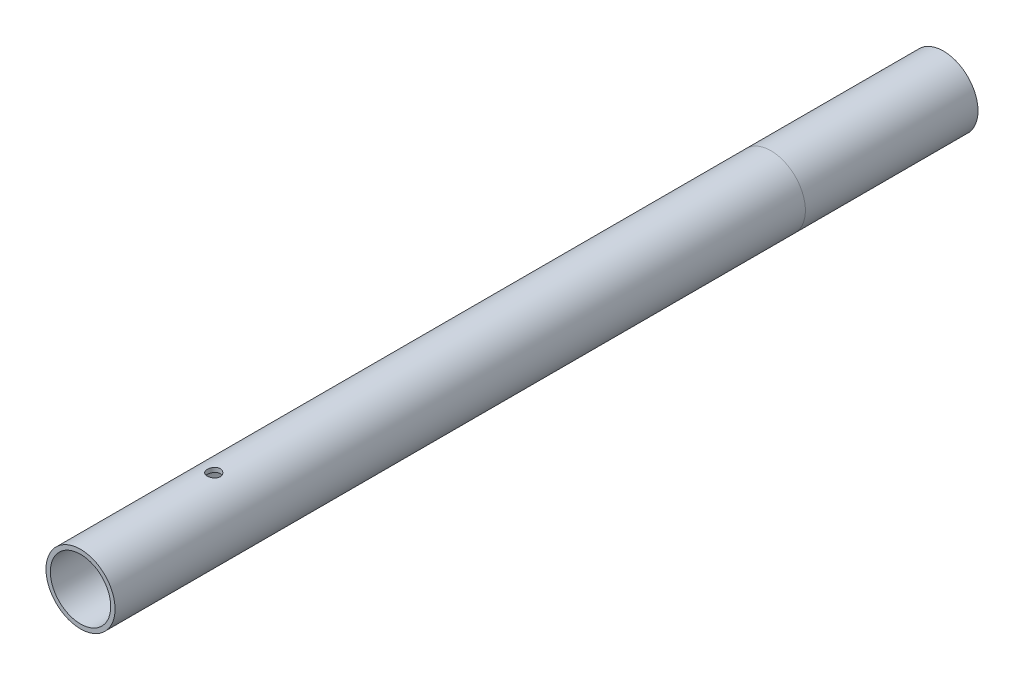
ISO-10303-21;
HEADER;
FILE_DESCRIPTION(('STEP AP214'),'2;1');
FILE_NAME('part.step','',(''),(''),'','','');
FILE_SCHEMA(('AUTOMOTIVE_DESIGN { 1 0 10303 214 1 1 1 1 }'));
ENDSEC;
DATA;
#1=APPLICATION_CONTEXT('core data for automotive mechanical design processes');
#2=APPLICATION_PROTOCOL_DEFINITION('international standard','automotive_design',2000,#1);
#3=PRODUCT_CONTEXT('',#1,'mechanical');
#4=PRODUCT('Part','Part','',(#3));
#5=PRODUCT_RELATED_PRODUCT_CATEGORY('part','',(#4));
#6=PRODUCT_DEFINITION_FORMATION('','',#4);
#7=PRODUCT_DEFINITION_CONTEXT('part definition',#1,'design');
#8=PRODUCT_DEFINITION('design','',#6,#7);
#9=PRODUCT_DEFINITION_SHAPE('','',#8);
#10=(LENGTH_UNIT() NAMED_UNIT(*) SI_UNIT(.MILLI.,.METRE.));
#11=(NAMED_UNIT(*) PLANE_ANGLE_UNIT() SI_UNIT($,.RADIAN.));
#12=(NAMED_UNIT(*) SI_UNIT($,.STERADIAN.) SOLID_ANGLE_UNIT());
#13=UNCERTAINTY_MEASURE_WITH_UNIT(LENGTH_MEASURE(1.E-05),#10,'distance_accuracy_value','');
#14=(GEOMETRIC_REPRESENTATION_CONTEXT(3) GLOBAL_UNCERTAINTY_ASSIGNED_CONTEXT((#13)) GLOBAL_UNIT_ASSIGNED_CONTEXT((#10,
#11,#12)) REPRESENTATION_CONTEXT('',''));
#15=CARTESIAN_POINT('',(0.,0.,0.));
#16=DIRECTION('',(0.,0.,1.));
#17=DIRECTION('',(1.,0.,0.));
#18=AXIS2_PLACEMENT_3D('',#15,#16,#17);
#19=CARTESIAN_POINT('',(0.,0.,200.));
#20=DIRECTION('',(0.,0.,-1.));
#21=DIRECTION('',(-1.,0.,0.));
#22=AXIS2_PLACEMENT_3D('',#19,#20,#21);
#23=CYLINDRICAL_SURFACE('',#22,8.);
#24=CARTESIAN_POINT('',(0.,-8.,170.63));
#25=CARTESIAN_POINT('',(0.083471746465471,-7.99999848833852,170.629996810412));
#26=CARTESIAN_POINT('',(0.166984992730098,-7.99868009921714,170.623008923381));
#27=CARTESIAN_POINT('',(0.331658129841796,-7.9935478589052,170.595260004882));
#28=CARTESIAN_POINT('',(0.412815974152224,-7.98973190166897,170.57448734936));
#29=CARTESIAN_POINT('',(0.570372961851795,-7.98003138765458,170.519827298741));
#30=CARTESIAN_POINT('',(0.646776330685334,-7.97414869946483,170.485951747547));
#31=CARTESIAN_POINT('',(0.792807973093995,-7.96095710599784,170.406081123077));
#32=CARTESIAN_POINT('',(0.862436794477313,-7.9536483161829,170.360087030855));
#33=CARTESIAN_POINT('',(0.993783715930497,-7.93831336430504,170.256700231996));
#34=CARTESIAN_POINT('',(1.05540895503183,-7.93028034856351,170.19919055533));
#35=CARTESIAN_POINT('',(1.16819606135369,-7.9144531845865,170.074656690912));
#36=CARTESIAN_POINT('',(1.21935717689241,-7.90665905354528,170.007631820231));
#37=CARTESIAN_POINT('',(1.31014998665793,-7.89212551245006,169.865313911636));
#38=CARTESIAN_POINT('',(1.34968721969605,-7.88539493886182,169.789959629683));
#39=CARTESIAN_POINT('',(1.41550524332283,-7.87384713211987,169.633531084823));
#40=CARTESIAN_POINT('',(1.44178717713099,-7.86902973396962,169.552457315889));
#41=CARTESIAN_POINT('',(1.480050535035,-7.8619226957455,169.387884769086));
#42=CARTESIAN_POINT('',(1.49219390192039,-7.85960445366405,169.304424902797));
#43=CARTESIAN_POINT('',(1.50233808095347,-7.85767197152761,169.136622615192));
#44=CARTESIAN_POINT('',(1.50034016135374,-7.85805748898759,169.052280273698));
#45=CARTESIAN_POINT('',(1.48238979602363,-7.86146292701752,168.886280474734));
#46=CARTESIAN_POINT('',(1.46662149996046,-7.86444808147334,168.8046022857));
#47=CARTESIAN_POINT('',(1.42186799396208,-7.87266183284666,168.645071580217));
#48=CARTESIAN_POINT('',(1.392882222395,-7.87789052509516,168.567219226491));
#49=CARTESIAN_POINT('',(1.322336471793,-7.89003855292588,168.417011321));
#50=CARTESIAN_POINT('',(1.28070213532456,-7.89696783823366,168.344691529419));
#51=CARTESIAN_POINT('',(1.18609368930416,-7.91172971602918,168.20799527146));
#52=CARTESIAN_POINT('',(1.13311842889266,-7.91956240015522,168.143619612285));
#53=CARTESIAN_POINT('',(1.01633905685297,-7.93540001272164,168.023575044328));
#54=CARTESIAN_POINT('',(0.952377436860678,-7.94340571024031,167.968059347548));
#55=CARTESIAN_POINT('',(0.815968037098825,-7.95857386108318,167.868522759325));
#56=CARTESIAN_POINT('',(0.743520172255773,-7.96573630595245,167.82450198313));
#57=CARTESIAN_POINT('',(0.592034988874674,-7.97842539677509,167.74918224613));
#58=CARTESIAN_POINT('',(0.512989564446497,-7.98394999136289,167.717899220882));
#59=CARTESIAN_POINT('',(0.3506391153987,-7.99272505402719,167.669097906908));
#60=CARTESIAN_POINT('',(0.267334544277792,-7.99597576367994,167.651578155955));
#61=CARTESIAN_POINT('',(0.100148652903392,-7.9998036064198,167.631013968982));
#62=CARTESIAN_POINT('',(0.0162940126341425,-8.00041950912279,167.62775960847));
#63=CARTESIAN_POINT('',(-0.150761248092176,-7.99901543598228,167.635255479548));
#64=CARTESIAN_POINT('',(-0.233961900480378,-7.99699558964431,167.646005023065));
#65=CARTESIAN_POINT('',(-0.396681573218207,-7.99057111500407,167.681029035183));
#66=CARTESIAN_POINT('',(-0.47622426104605,-7.98618522374031,167.705197282538));
#67=CARTESIAN_POINT('',(-0.63012863182462,-7.97551842212498,167.766257706779));
#68=CARTESIAN_POINT('',(-0.704489962595092,-7.96923738311335,167.803150747566));
#69=CARTESIAN_POINT('',(-0.846816671513208,-7.95538030357666,167.889078128159));
#70=CARTESIAN_POINT('',(-0.914703277015118,-7.94779086174563,167.938240738537));
#71=CARTESIAN_POINT('',(-1.04133832326454,-7.93219343489711,168.047138137362));
#72=CARTESIAN_POINT('',(-1.10008590976086,-7.92418541084687,168.106873913001));
#73=CARTESIAN_POINT('',(-1.20757295872047,-7.9085247569745,168.236172318911));
#74=CARTESIAN_POINT('',(-1.25616916218576,-7.90087825860257,168.305854908125));
#75=CARTESIAN_POINT('',(-1.34096675057787,-7.88692985578532,168.452517624524));
#76=CARTESIAN_POINT('',(-1.37716859613924,-7.8806279013735,168.52949748037));
#77=CARTESIAN_POINT('',(-1.43594673512823,-7.87013024209574,168.688205867243));
#78=CARTESIAN_POINT('',(-1.45858868794786,-7.86592440436878,168.769909379559));
#79=CARTESIAN_POINT('',(-1.48980679326235,-7.86007203802415,168.936047222521));
#80=CARTESIAN_POINT('',(-1.49838453270708,-7.8584252206579,169.02048124397));
#81=CARTESIAN_POINT('',(-1.50117762148355,-7.85789199803857,169.188248331442));
#82=CARTESIAN_POINT('',(-1.49561895003499,-7.85896215974293,169.271577580957));
#83=CARTESIAN_POINT('',(-1.47079175378803,-7.86364600659998,169.436091422045));
#84=CARTESIAN_POINT('',(-1.45152331089332,-7.86725967655746,169.517276026427));
#85=CARTESIAN_POINT('',(-1.39991887583264,-7.8766050802318,169.675074484795));
#86=CARTESIAN_POINT('',(-1.36760735397254,-7.88233284594965,169.751696591346));
#87=CARTESIAN_POINT('',(-1.29085868912206,-7.8952638755184,169.898468254241));
#88=CARTESIAN_POINT('',(-1.24642068948187,-7.90246724360119,169.968617352845));
#89=CARTESIAN_POINT('',(-1.14589487339536,-7.91767266107745,170.101583680042));
#90=CARTESIAN_POINT('',(-1.08964259864305,-7.92568505353043,170.164275412567));
#91=CARTESIAN_POINT('',(-0.967427926742305,-7.94152833918735,170.279405162465));
#92=CARTESIAN_POINT('',(-0.901463301891633,-7.94935919027328,170.33184082098));
#93=CARTESIAN_POINT('',(-0.760984945071896,-7.96403975968049,170.425410952627));
#94=CARTESIAN_POINT('',(-0.686399590640543,-7.97088000990561,170.466439428491));
#95=CARTESIAN_POINT('',(-0.531290113653857,-7.98271619380687,170.535317636605));
#96=CARTESIAN_POINT('',(-0.450771651705265,-7.98771385879037,170.563179747047));
#97=CARTESIAN_POINT('',(-0.308347202825166,-7.99428290707632,170.599277314419));
#98=CARTESIAN_POINT('',(-0.247273810251881,-7.99641470878206,170.610778630313));
#99=CARTESIAN_POINT('',(-0.124141247115165,-7.9992737995401,170.626141062116));
#100=CARTESIAN_POINT('',(-0.0620821016527126,-8.00000112429805,170.630002372256));
#101=CARTESIAN_POINT('',(0.,-8.,170.63));
#102=B_SPLINE_CURVE_WITH_KNOTS('',3,(#24,#25,#26,#27,#28,#29,#30,#31,#32,#33,#34,#35,#36,#37,
#38,#39,#40,#41,#42,#43,#44,#45,#46,#47,#48,#49,#50,#51,#52,#53,#54,#55,#56,#57,#58,#59,#60,#61,
#62,#63,#64,#65,#66,#67,#68,#69,#70,#71,#72,#73,#74,#75,#76,#77,#78,#79,#80,#81,#82,#83,#84,#85,
#86,#87,#88,#89,#90,#91,#92,#93,#94,#95,#96,#97,#98,#99,#100,#101),.UNSPECIFIED.,.T.,.F.,(4,2,2,
2,2,2,2,2,2,2,2,2,2,2,2,2,2,2,2,2,2,2,2,2,2,2,2,2,2,2,2,2,2,2,2,2,2,2,4),(0.,0.250188200964923,
0.500587642535447,0.750761271230892,1.00091465336891,1.2537511801363,1.50660586283616,
1.76146190504356,2.01629596311951,2.26818151445336,2.52004447587254,2.76859000612763,
3.01714609846788,3.26719262629534,3.51726454049861,3.77127768464078,4.02529337544948,
4.27962588321699,4.53393136673746,4.78448174076097,5.03501980464584,5.28360233907829,
5.53220175338032,5.78351778017709,6.03485728413099,6.28953436987299,6.54420198954946,
6.79762627818558,7.05102196946515,7.30039252231752,7.54976158541508,7.79866496207693,
8.04758592655423,8.30023369966383,8.55293951262255,8.80792048916314,9.06266126931174,
9.24874344524411,9.43482089039543),.UNSPECIFIED.);
#103=CARTESIAN_POINT('',(0.,-8.,170.63));
#104=VERTEX_POINT('',#103);
#105=EDGE_CURVE('E90',#104,#104,#102,.T.);
#106=ORIENTED_EDGE('',*,*,#105,.T.);
#107=EDGE_LOOP('',(#106));
#108=FACE_BOUND('',#107,.T.);
#109=CARTESIAN_POINT('',(0.,8.,170.63));
#110=CARTESIAN_POINT('',(-0.083471746465471,7.99999848833852,170.629996810412));
#111=CARTESIAN_POINT('',(-0.166984992730098,7.99868009921714,170.623008923381));
#112=CARTESIAN_POINT('',(-0.331658129841796,7.9935478589052,170.595260004882));
#113=CARTESIAN_POINT('',(-0.412815974152224,7.98973190166897,170.57448734936));
#114=CARTESIAN_POINT('',(-0.570372961851795,7.98003138765458,170.519827298741));
#115=CARTESIAN_POINT('',(-0.646776330685334,7.97414869946483,170.485951747547));
#116=CARTESIAN_POINT('',(-0.792807973093995,7.96095710599784,170.406081123077));
#117=CARTESIAN_POINT('',(-0.862436794477313,7.9536483161829,170.360087030855));
#118=CARTESIAN_POINT('',(-0.993783715930497,7.93831336430504,170.256700231996));
#119=CARTESIAN_POINT('',(-1.05540895503183,7.93028034856351,170.19919055533));
#120=CARTESIAN_POINT('',(-1.16819606135369,7.9144531845865,170.074656690912));
#121=CARTESIAN_POINT('',(-1.21935717689241,7.90665905354528,170.007631820231));
#122=CARTESIAN_POINT('',(-1.31014998665793,7.89212551245006,169.865313911636));
#123=CARTESIAN_POINT('',(-1.34968721969605,7.88539493886182,169.789959629683));
#124=CARTESIAN_POINT('',(-1.41550524332283,7.87384713211987,169.633531084823));
#125=CARTESIAN_POINT('',(-1.44178717713099,7.86902973396962,169.552457315889));
#126=CARTESIAN_POINT('',(-1.480050535035,7.8619226957455,169.387884769086));
#127=CARTESIAN_POINT('',(-1.49219390192039,7.85960445366405,169.304424902797));
#128=CARTESIAN_POINT('',(-1.50233808095347,7.85767197152761,169.136622615192));
#129=CARTESIAN_POINT('',(-1.50034016135374,7.85805748898759,169.052280273698));
#130=CARTESIAN_POINT('',(-1.48238979602363,7.86146292701752,168.886280474734));
#131=CARTESIAN_POINT('',(-1.46662149996046,7.86444808147334,168.8046022857));
#132=CARTESIAN_POINT('',(-1.42186799396208,7.87266183284666,168.645071580217));
#133=CARTESIAN_POINT('',(-1.392882222395,7.87789052509516,168.567219226491));
#134=CARTESIAN_POINT('',(-1.322336471793,7.89003855292588,168.417011321));
#135=CARTESIAN_POINT('',(-1.28070213532456,7.89696783823366,168.344691529419));
#136=CARTESIAN_POINT('',(-1.18609368930416,7.91172971602918,168.20799527146));
#137=CARTESIAN_POINT('',(-1.13311842889266,7.91956240015522,168.143619612285));
#138=CARTESIAN_POINT('',(-1.01633905685297,7.93540001272164,168.023575044328));
#139=CARTESIAN_POINT('',(-0.952377436860678,7.94340571024031,167.968059347548));
#140=CARTESIAN_POINT('',(-0.815968037098825,7.95857386108318,167.868522759325));
#141=CARTESIAN_POINT('',(-0.743520172255773,7.96573630595245,167.82450198313));
#142=CARTESIAN_POINT('',(-0.592034988874674,7.97842539677509,167.74918224613));
#143=CARTESIAN_POINT('',(-0.512989564446497,7.98394999136289,167.717899220882));
#144=CARTESIAN_POINT('',(-0.3506391153987,7.99272505402719,167.669097906908));
#145=CARTESIAN_POINT('',(-0.267334544277792,7.99597576367994,167.651578155955));
#146=CARTESIAN_POINT('',(-0.100148652903392,7.9998036064198,167.631013968982));
#147=CARTESIAN_POINT('',(-0.0162940126341425,8.00041950912279,167.62775960847));
#148=CARTESIAN_POINT('',(0.150761248092176,7.99901543598228,167.635255479548));
#149=CARTESIAN_POINT('',(0.233961900480378,7.99699558964431,167.646005023065));
#150=CARTESIAN_POINT('',(0.396681573218207,7.99057111500407,167.681029035183));
#151=CARTESIAN_POINT('',(0.47622426104605,7.98618522374031,167.705197282538));
#152=CARTESIAN_POINT('',(0.63012863182462,7.97551842212498,167.766257706779));
#153=CARTESIAN_POINT('',(0.704489962595092,7.96923738311335,167.803150747566));
#154=CARTESIAN_POINT('',(0.846816671513208,7.95538030357666,167.889078128159));
#155=CARTESIAN_POINT('',(0.914703277015118,7.94779086174563,167.938240738537));
#156=CARTESIAN_POINT('',(1.04133832326454,7.93219343489711,168.047138137362));
#157=CARTESIAN_POINT('',(1.10008590976086,7.92418541084687,168.106873913001));
#158=CARTESIAN_POINT('',(1.20757295872047,7.9085247569745,168.236172318911));
#159=CARTESIAN_POINT('',(1.25616916218576,7.90087825860257,168.305854908125));
#160=CARTESIAN_POINT('',(1.34096675057787,7.88692985578532,168.452517624524));
#161=CARTESIAN_POINT('',(1.37716859613924,7.8806279013735,168.52949748037));
#162=CARTESIAN_POINT('',(1.43594673512823,7.87013024209574,168.688205867243));
#163=CARTESIAN_POINT('',(1.45858868794786,7.86592440436878,168.769909379559));
#164=CARTESIAN_POINT('',(1.48980679326235,7.86007203802415,168.936047222521));
#165=CARTESIAN_POINT('',(1.49838453270708,7.8584252206579,169.02048124397));
#166=CARTESIAN_POINT('',(1.50117762148355,7.85789199803857,169.188248331442));
#167=CARTESIAN_POINT('',(1.49561895003499,7.85896215974293,169.271577580957));
#168=CARTESIAN_POINT('',(1.47079175378803,7.86364600659998,169.436091422045));
#169=CARTESIAN_POINT('',(1.45152331089332,7.86725967655746,169.517276026427));
#170=CARTESIAN_POINT('',(1.39991887583264,7.8766050802318,169.675074484795));
#171=CARTESIAN_POINT('',(1.36760735397254,7.88233284594965,169.751696591346));
#172=CARTESIAN_POINT('',(1.29085868912206,7.8952638755184,169.898468254241));
#173=CARTESIAN_POINT('',(1.24642068948187,7.90246724360119,169.968617352845));
#174=CARTESIAN_POINT('',(1.14589487339536,7.91767266107745,170.101583680042));
#175=CARTESIAN_POINT('',(1.08964259864305,7.92568505353043,170.164275412567));
#176=CARTESIAN_POINT('',(0.967427926742305,7.94152833918735,170.279405162465));
#177=CARTESIAN_POINT('',(0.901463301891633,7.94935919027328,170.33184082098));
#178=CARTESIAN_POINT('',(0.760984945071896,7.96403975968049,170.425410952627));
#179=CARTESIAN_POINT('',(0.686399590640543,7.97088000990561,170.466439428491));
#180=CARTESIAN_POINT('',(0.531290113653857,7.98271619380687,170.535317636605));
#181=CARTESIAN_POINT('',(0.450771651705265,7.98771385879037,170.563179747047));
#182=CARTESIAN_POINT('',(0.308347202825166,7.99428290707632,170.599277314419));
#183=CARTESIAN_POINT('',(0.247273810251881,7.99641470878206,170.610778630313));
#184=CARTESIAN_POINT('',(0.124141247115165,7.9992737995401,170.626141062116));
#185=CARTESIAN_POINT('',(0.0620821016527126,8.00000112429805,170.630002372256));
#186=CARTESIAN_POINT('',(0.,8.,170.63));
#187=B_SPLINE_CURVE_WITH_KNOTS('',3,(#109,#110,#111,#112,#113,#114,#115,#116,#117,#118,#119,
#120,#121,#122,#123,#124,#125,#126,#127,#128,#129,#130,#131,#132,#133,#134,#135,#136,#137,#138,
#139,#140,#141,#142,#143,#144,#145,#146,#147,#148,#149,#150,#151,#152,#153,#154,#155,#156,#157,
#158,#159,#160,#161,#162,#163,#164,#165,#166,#167,#168,#169,#170,#171,#172,#173,#174,#175,#176,
#177,#178,#179,#180,#181,#182,#183,#184,#185,#186),.UNSPECIFIED.,.T.,.F.,(4,2,2,2,2,2,2,2,2,2,2,
2,2,2,2,2,2,2,2,2,2,2,2,2,2,2,2,2,2,2,2,2,2,2,2,2,2,2,4),(0.,0.250188200964923,
0.500587642535447,0.750761271230892,1.00091465336891,1.2537511801363,1.50660586283616,
1.76146190504356,2.01629596311951,2.26818151445336,2.52004447587254,2.76859000612763,
3.01714609846788,3.26719262629534,3.51726454049861,3.77127768464078,4.02529337544948,
4.27962588321699,4.53393136673746,4.78448174076097,5.03501980464584,5.28360233907829,
5.53220175338032,5.78351778017709,6.03485728413099,6.28953436987299,6.54420198954946,
6.79762627818558,7.05102196946515,7.30039252231752,7.54976158541508,7.79866496207693,
8.04758592655423,8.30023369966383,8.55293951262255,8.80792048916314,9.06266126931174,
9.24874344524411,9.43482089039543),.UNSPECIFIED.);
#188=CARTESIAN_POINT('',(0.,8.,170.63));
#189=VERTEX_POINT('',#188);
#190=EDGE_CURVE('E85',#189,#189,#187,.T.);
#191=ORIENTED_EDGE('',*,*,#190,.T.);
#192=EDGE_LOOP('',(#191));
#193=FACE_BOUND('',#192,.T.);
#194=CARTESIAN_POINT('',(0.,0.,200.));
#195=DIRECTION('',(0.,0.,1.));
#196=DIRECTION('',(1.,0.,0.));
#197=AXIS2_PLACEMENT_3D('',#194,#195,#196);
#198=CIRCLE('',#197,8.);
#199=CARTESIAN_POINT('',(8.,0.,200.));
#200=VERTEX_POINT('',#199);
#201=EDGE_CURVE('E57',#200,#200,#198,.T.);
#202=ORIENTED_EDGE('',*,*,#201,.F.);
#203=EDGE_LOOP('',(#202));
#204=FACE_BOUND('',#203,.T.);
#205=CARTESIAN_POINT('',(0.,0.,40.));
#206=DIRECTION('',(0.,0.,-1.));
#207=DIRECTION('',(-1.,0.,0.));
#208=AXIS2_PLACEMENT_3D('',#205,#206,#207);
#209=CIRCLE('',#208,8.);
#210=CARTESIAN_POINT('',(-8.,0.,40.));
#211=VERTEX_POINT('',#210);
#212=EDGE_CURVE('E10',#211,#211,#209,.T.);
#213=ORIENTED_EDGE('',*,*,#212,.F.);
#214=EDGE_LOOP('',(#213));
#215=FACE_BOUND('',#214,.T.);
#216=ADVANCED_FACE('F42',(#108,#193,#204,#215),#23,.T.);
#217=CARTESIAN_POINT('',(0.,0.,200.));
#218=DIRECTION('',(0.,0.,1.));
#219=DIRECTION('',(1.,0.,0.));
#220=AXIS2_PLACEMENT_3D('',#217,#218,#219);
#221=PLANE('',#220);
#222=ORIENTED_EDGE('',*,*,#201,.T.);
#223=EDGE_LOOP('',(#222));
#224=FACE_BOUND('',#223,.T.);
#225=CARTESIAN_POINT('',(0.,0.,200.));
#226=DIRECTION('',(0.,0.,1.));
#227=DIRECTION('',(1.,0.,0.));
#228=AXIS2_PLACEMENT_3D('',#225,#226,#227);
#229=CIRCLE('',#228,7.);
#230=CARTESIAN_POINT('',(7.,0.,200.));
#231=VERTEX_POINT('',#230);
#232=EDGE_CURVE('E97',#231,#231,#229,.T.);
#233=ORIENTED_EDGE('',*,*,#232,.F.);
#234=EDGE_LOOP('',(#233));
#235=FACE_BOUND('',#234,.T.);
#236=ADVANCED_FACE('F115',(#224,#235),#221,.T.);
#237=CARTESIAN_POINT('',(0.,0.,0.));
#238=DIRECTION('',(0.,0.,1.));
#239=DIRECTION('',(1.,0.,0.));
#240=AXIS2_PLACEMENT_3D('',#237,#238,#239);
#241=PLANE('',#240);
#242=CARTESIAN_POINT('',(0.,0.,0.));
#243=DIRECTION('',(0.,0.,1.));
#244=DIRECTION('',(1.,0.,0.));
#245=AXIS2_PLACEMENT_3D('',#242,#243,#244);
#246=CIRCLE('',#245,8.);
#247=CARTESIAN_POINT('',(8.,0.,0.));
#248=VERTEX_POINT('',#247);
#249=EDGE_CURVE('E64',#248,#248,#246,.T.);
#250=ORIENTED_EDGE('',*,*,#249,.F.);
#251=EDGE_LOOP('',(#250));
#252=FACE_BOUND('',#251,.T.);
#253=CARTESIAN_POINT('',(0.,0.,0.));
#254=DIRECTION('',(0.,0.,1.));
#255=DIRECTION('',(1.,0.,0.));
#256=AXIS2_PLACEMENT_3D('',#253,#254,#255);
#257=CIRCLE('',#256,7.);
#258=CARTESIAN_POINT('',(7.,0.,0.));
#259=VERTEX_POINT('',#258);
#260=EDGE_CURVE('E96',#259,#259,#257,.T.);
#261=ORIENTED_EDGE('',*,*,#260,.T.);
#262=EDGE_LOOP('',(#261));
#263=FACE_BOUND('',#262,.T.);
#264=ADVANCED_FACE('F103',(#252,#263),#241,.F.);
#265=ORIENTED_EDGE('',*,*,#212,.T.);
#266=EDGE_LOOP('',(#265));
#267=FACE_BOUND('',#266,.T.);
#268=ORIENTED_EDGE('',*,*,#249,.T.);
#269=EDGE_LOOP('',(#268));
#270=FACE_BOUND('',#269,.T.);
#271=ADVANCED_FACE('F44',(#267,#270),#23,.T.);
#272=CARTESIAN_POINT('',(0.,0.,200.));
#273=DIRECTION('',(0.,0.,-1.));
#274=DIRECTION('',(-1.,0.,0.));
#275=AXIS2_PLACEMENT_3D('',#272,#273,#274);
#276=CYLINDRICAL_SURFACE('',#275,7.);
#277=CARTESIAN_POINT('',(0.,-7.,170.63));
#278=CARTESIAN_POINT('',(0.0832358860906173,-6.99999846043226,170.629997100426));
#279=CARTESIAN_POINT('',(0.166507195600276,-6.9985002594971,170.623048391612));
#280=CARTESIAN_POINT('',(0.330687344293328,-6.99266829827727,170.595464343146));
#281=CARTESIAN_POINT('',(0.411594403571189,-6.98833245637099,170.574818955805));
#282=CARTESIAN_POINT('',(0.568649323817736,-6.97730831788826,170.520515635392));
#283=CARTESIAN_POINT('',(0.644801963446558,-6.97062242967171,170.486871020619));
#284=CARTESIAN_POINT('',(0.790378177960793,-6.95562106817971,170.407565913829));
#285=CARTESIAN_POINT('',(0.859801981747376,-6.94730565036661,170.36190583075));
#286=CARTESIAN_POINT('',(0.99102479053523,-6.92981369246311,170.259119700326));
#287=CARTESIAN_POINT('',(1.05270503419445,-6.92062683143259,170.201843778101));
#288=CARTESIAN_POINT('',(1.16566042389434,-6.90250069814145,170.077773684315));
#289=CARTESIAN_POINT('',(1.21693467150908,-6.8935614473163,170.010978691749));
#290=CARTESIAN_POINT('',(1.30814204379808,-6.87684116047225,169.86889424714));
#291=CARTESIAN_POINT('',(1.34794958335008,-6.8690733634436,169.793522482244));
#292=CARTESIAN_POINT('',(1.41428823691146,-6.85572325558537,169.636965546233));
#293=CARTESIAN_POINT('',(1.44082087001715,-6.85014069470711,169.555781041507));
#294=CARTESIAN_POINT('',(1.47946574422454,-6.84189808926311,169.391188913412));
#295=CARTESIAN_POINT('',(1.49178779748343,-6.83919556896486,169.307832724336));
#296=CARTESIAN_POINT('',(1.50231395206577,-6.83689139845106,169.140195767493));
#297=CARTESIAN_POINT('',(1.5005197166463,-6.83728938291729,169.05591510982));
#298=CARTESIAN_POINT('',(1.48303326340861,-6.84110276603832,168.890375312066));
#299=CARTESIAN_POINT('',(1.46758398649408,-6.84446541682162,168.8090891109));
#300=CARTESIAN_POINT('',(1.42361054298677,-6.85374593375788,168.650289759711));
#301=CARTESIAN_POINT('',(1.39508566936465,-6.85966393808402,168.572776813968));
#302=CARTESIAN_POINT('',(1.32554551075991,-6.87344080755724,168.423037127127));
#303=CARTESIAN_POINT('',(1.2844361097283,-6.88131420983365,168.350855487287));
#304=CARTESIAN_POINT('',(1.19096007283993,-6.89810572501288,168.214324835042));
#305=CARTESIAN_POINT('',(1.13859196103562,-6.90702397481896,168.149976851314));
#306=CARTESIAN_POINT('',(1.0227954275532,-6.92512718393878,168.029540644327));
#307=CARTESIAN_POINT('',(0.9591602339644,-6.93431383972178,167.973651293415));
#308=CARTESIAN_POINT('',(0.823317306269083,-6.95175017497059,167.87330626631));
#309=CARTESIAN_POINT('',(0.751109428775393,-6.95999983875972,167.8288507814));
#310=CARTESIAN_POINT('',(0.599933462049958,-6.97465778534003,167.752589320093));
#311=CARTESIAN_POINT('',(0.520952258863481,-6.98106238643354,167.720808587422));
#312=CARTESIAN_POINT('',(0.35860314668571,-6.99128109245334,167.671024351679));
#313=CARTESIAN_POINT('',(0.275235851133678,-6.99509555860384,167.653018927437));
#314=CARTESIAN_POINT('',(0.108187670836641,-6.99965306347808,167.631583785857));
#315=CARTESIAN_POINT('',(0.0245431772716253,-7.00045336521066,167.627882287118));
#316=CARTESIAN_POINT('',(-0.142168973650396,-6.99905248935969,167.634424571125));
#317=CARTESIAN_POINT('',(-0.225236668127246,-6.99685150675698,167.644667447963));
#318=CARTESIAN_POINT('',(-0.387542537982801,-6.98973143045266,167.678582243662));
#319=CARTESIAN_POINT('',(-0.466811712908477,-6.9848410504546,167.702112369473));
#320=CARTESIAN_POINT('',(-0.620278450473415,-6.9728892442151,167.761776942995));
#321=CARTESIAN_POINT('',(-0.694475592587731,-6.96582763822237,167.797912434312));
#322=CARTESIAN_POINT('',(-0.836821397964744,-6.950175043904,167.88233354306));
#323=CARTESIAN_POINT('',(-0.904872575111137,-6.94156431354275,167.93077979491));
#324=CARTESIAN_POINT('',(-1.0319769255236,-6.92381033034847,168.038234824889));
#325=CARTESIAN_POINT('',(-1.09102897869199,-6.91466701142097,168.097244915887));
#326=CARTESIAN_POINT('',(-1.19952711057989,-6.89668172706324,168.225397370187));
#327=CARTESIAN_POINT('',(-1.24878537255157,-6.88784792221285,168.294700099222));
#328=CARTESIAN_POINT('',(-1.3349641538604,-6.87166654559681,168.440754596478));
#329=CARTESIAN_POINT('',(-1.37188519913705,-6.86431891048055,168.517506046978));
#330=CARTESIAN_POINT('',(-1.43209741248547,-6.8520100980739,168.675872298995));
#331=CARTESIAN_POINT('',(-1.45546398641275,-6.84703574582967,168.757457356431));
#332=CARTESIAN_POINT('',(-1.48812696085336,-6.84001186708418,168.923515583834));
#333=CARTESIAN_POINT('',(-1.49742550780258,-6.83796189439706,169.007988311201));
#334=CARTESIAN_POINT('',(-1.50159999926041,-6.83704618848156,169.175532343175));
#335=CARTESIAN_POINT('',(-1.49677347258311,-6.83811476518543,169.258596014981));
#336=CARTESIAN_POINT('',(-1.47349789406331,-6.8431676318483,169.422697242133));
#337=CARTESIAN_POINT('',(-1.45504898957979,-6.84715189026714,169.503734819387));
#338=CARTESIAN_POINT('',(-1.40519345940434,-6.85755581104157,169.661258657869));
#339=CARTESIAN_POINT('',(-1.37382847170887,-6.86396764224703,169.737758648664));
#340=CARTESIAN_POINT('',(-1.299067515956,-6.87850764590649,169.884455372507));
#341=CARTESIAN_POINT('',(-1.25567035301499,-6.88663598880363,169.954651478615));
#342=CARTESIAN_POINT('',(-1.15708290349303,-6.90389055593232,170.088218193725));
#343=CARTESIAN_POINT('',(-1.10167987421236,-6.91303309938927,170.151429695947));
#344=CARTESIAN_POINT('',(-0.981086554619621,-6.93117449799694,170.26775626252));
#345=CARTESIAN_POINT('',(-0.915894009385597,-6.94017331951296,170.320868994312));
#346=CARTESIAN_POINT('',(-0.77660314726872,-6.95714491048987,170.416115959506));
#347=CARTESIAN_POINT('',(-0.702404846009648,-6.96510364570626,170.458106606231));
#348=CARTESIAN_POINT('',(-0.547850160940612,-6.97895826104019,170.528954528906));
#349=CARTESIAN_POINT('',(-0.467499105863898,-6.98485590212342,170.557823022585));
#350=CARTESIAN_POINT('',(-0.322535217553221,-6.99284848461772,170.596352185131));
#351=CARTESIAN_POINT('',(-0.258717205545992,-6.99551391888263,170.60894643398));
#352=CARTESIAN_POINT('',(-0.129939960853852,-6.99909024154719,170.625771301712));
#353=CARTESIAN_POINT('',(-0.0649807750887481,-7.00000120191314,170.630002263646));
#354=CARTESIAN_POINT('',(0.,-7.,170.63));
#355=B_SPLINE_CURVE_WITH_KNOTS('',3,(#277,#278,#279,#280,#281,#282,#283,#284,#285,#286,#287,
#288,#289,#290,#291,#292,#293,#294,#295,#296,#297,#298,#299,#300,#301,#302,#303,#304,#305,#306,
#307,#308,#309,#310,#311,#312,#313,#314,#315,#316,#317,#318,#319,#320,#321,#322,#323,#324,#325,
#326,#327,#328,#329,#330,#331,#332,#333,#334,#335,#336,#337,#338,#339,#340,#341,#342,#343,#344,
#345,#346,#347,#348,#349,#350,#351,#352,#353,#354),.UNSPECIFIED.,.T.,.F.,(4,2,2,2,2,2,2,2,2,2,2,
2,2,2,2,2,2,2,2,2,2,2,2,2,2,2,2,2,2,2,2,2,2,2,2,2,2,2,4),(0.,0.249469836512083,
0.499122883219934,0.748520824425613,0.997910278645895,1.25074961881732,1.50361077918505,
1.75914429214509,2.01464855677487,2.26633008124666,2.51798195169166,2.76524475452927,
3.01252092904569,3.2616935616597,3.51089887920889,3.76527011050293,4.01964559702352,
4.27452521139806,4.52936927256342,4.77934665704184,5.02930780231429,5.27665060589267,
5.52401389198434,5.77478733867803,6.02559197304484,6.28082063283534,6.53603841075805,
6.78982240408476,7.04356767229185,7.29200680540296,7.54044325108271,7.78808499706788,
8.03575134451626,8.28822950154115,8.54076590397116,8.79641910357222,9.0518533401027,
9.24661799132294,9.44137465337337),.UNSPECIFIED.);
#356=CARTESIAN_POINT('',(0.,-7.,170.63));
#357=VERTEX_POINT('',#356);
#358=EDGE_CURVE('E47',#357,#357,#355,.T.);
#359=ORIENTED_EDGE('',*,*,#358,.F.);
#360=EDGE_LOOP('',(#359));
#361=FACE_BOUND('',#360,.T.);
#362=CARTESIAN_POINT('',(0.,7.,170.63));
#363=CARTESIAN_POINT('',(-0.0832358860906173,6.99999846043226,170.629997100426));
#364=CARTESIAN_POINT('',(-0.166507195600276,6.9985002594971,170.623048391612));
#365=CARTESIAN_POINT('',(-0.330687344293328,6.99266829827727,170.595464343146));
#366=CARTESIAN_POINT('',(-0.411594403571189,6.98833245637099,170.574818955805));
#367=CARTESIAN_POINT('',(-0.568649323817736,6.97730831788826,170.520515635392));
#368=CARTESIAN_POINT('',(-0.644801963446558,6.97062242967171,170.486871020619));
#369=CARTESIAN_POINT('',(-0.790378177960793,6.95562106817971,170.407565913829));
#370=CARTESIAN_POINT('',(-0.859801981747376,6.94730565036661,170.36190583075));
#371=CARTESIAN_POINT('',(-0.99102479053523,6.92981369246311,170.259119700326));
#372=CARTESIAN_POINT('',(-1.05270503419445,6.92062683143259,170.201843778101));
#373=CARTESIAN_POINT('',(-1.16566042389434,6.90250069814145,170.077773684315));
#374=CARTESIAN_POINT('',(-1.21693467150908,6.8935614473163,170.010978691749));
#375=CARTESIAN_POINT('',(-1.30814204379808,6.87684116047225,169.86889424714));
#376=CARTESIAN_POINT('',(-1.34794958335008,6.8690733634436,169.793522482244));
#377=CARTESIAN_POINT('',(-1.41428823691146,6.85572325558537,169.636965546233));
#378=CARTESIAN_POINT('',(-1.44082087001715,6.85014069470711,169.555781041507));
#379=CARTESIAN_POINT('',(-1.47946574422454,6.84189808926311,169.391188913412));
#380=CARTESIAN_POINT('',(-1.49178779748343,6.83919556896486,169.307832724336));
#381=CARTESIAN_POINT('',(-1.50231395206577,6.83689139845106,169.140195767493));
#382=CARTESIAN_POINT('',(-1.5005197166463,6.83728938291729,169.05591510982));
#383=CARTESIAN_POINT('',(-1.48303326340861,6.84110276603832,168.890375312066));
#384=CARTESIAN_POINT('',(-1.46758398649408,6.84446541682162,168.8090891109));
#385=CARTESIAN_POINT('',(-1.42361054298677,6.85374593375788,168.650289759711));
#386=CARTESIAN_POINT('',(-1.39508566936465,6.85966393808402,168.572776813968));
#387=CARTESIAN_POINT('',(-1.32554551075991,6.87344080755724,168.423037127127));
#388=CARTESIAN_POINT('',(-1.2844361097283,6.88131420983365,168.350855487287));
#389=CARTESIAN_POINT('',(-1.19096007283993,6.89810572501288,168.214324835042));
#390=CARTESIAN_POINT('',(-1.13859196103562,6.90702397481896,168.149976851314));
#391=CARTESIAN_POINT('',(-1.0227954275532,6.92512718393878,168.029540644327));
#392=CARTESIAN_POINT('',(-0.9591602339644,6.93431383972178,167.973651293415));
#393=CARTESIAN_POINT('',(-0.823317306269083,6.95175017497059,167.87330626631));
#394=CARTESIAN_POINT('',(-0.751109428775393,6.95999983875972,167.8288507814));
#395=CARTESIAN_POINT('',(-0.599933462049958,6.97465778534003,167.752589320093));
#396=CARTESIAN_POINT('',(-0.520952258863481,6.98106238643354,167.720808587422));
#397=CARTESIAN_POINT('',(-0.35860314668571,6.99128109245334,167.671024351679));
#398=CARTESIAN_POINT('',(-0.275235851133678,6.99509555860384,167.653018927437));
#399=CARTESIAN_POINT('',(-0.108187670836641,6.99965306347808,167.631583785857));
#400=CARTESIAN_POINT('',(-0.0245431772716253,7.00045336521066,167.627882287118));
#401=CARTESIAN_POINT('',(0.142168973650396,6.99905248935969,167.634424571125));
#402=CARTESIAN_POINT('',(0.225236668127246,6.99685150675698,167.644667447963));
#403=CARTESIAN_POINT('',(0.387542537982801,6.98973143045266,167.678582243662));
#404=CARTESIAN_POINT('',(0.466811712908477,6.9848410504546,167.702112369473));
#405=CARTESIAN_POINT('',(0.620278450473415,6.9728892442151,167.761776942995));
#406=CARTESIAN_POINT('',(0.694475592587731,6.96582763822237,167.797912434312));
#407=CARTESIAN_POINT('',(0.836821397964744,6.950175043904,167.88233354306));
#408=CARTESIAN_POINT('',(0.904872575111137,6.94156431354275,167.93077979491));
#409=CARTESIAN_POINT('',(1.0319769255236,6.92381033034847,168.038234824889));
#410=CARTESIAN_POINT('',(1.09102897869199,6.91466701142097,168.097244915887));
#411=CARTESIAN_POINT('',(1.19952711057989,6.89668172706324,168.225397370187));
#412=CARTESIAN_POINT('',(1.24878537255157,6.88784792221285,168.294700099222));
#413=CARTESIAN_POINT('',(1.3349641538604,6.87166654559681,168.440754596478));
#414=CARTESIAN_POINT('',(1.37188519913705,6.86431891048055,168.517506046978));
#415=CARTESIAN_POINT('',(1.43209741248547,6.8520100980739,168.675872298995));
#416=CARTESIAN_POINT('',(1.45546398641275,6.84703574582967,168.757457356431));
#417=CARTESIAN_POINT('',(1.48812696085336,6.84001186708418,168.923515583834));
#418=CARTESIAN_POINT('',(1.49742550780258,6.83796189439706,169.007988311201));
#419=CARTESIAN_POINT('',(1.50159999926041,6.83704618848156,169.175532343175));
#420=CARTESIAN_POINT('',(1.49677347258311,6.83811476518543,169.258596014981));
#421=CARTESIAN_POINT('',(1.47349789406331,6.8431676318483,169.422697242133));
#422=CARTESIAN_POINT('',(1.45504898957979,6.84715189026714,169.503734819387));
#423=CARTESIAN_POINT('',(1.40519345940434,6.85755581104157,169.661258657869));
#424=CARTESIAN_POINT('',(1.37382847170887,6.86396764224703,169.737758648664));
#425=CARTESIAN_POINT('',(1.299067515956,6.87850764590649,169.884455372507));
#426=CARTESIAN_POINT('',(1.25567035301499,6.88663598880363,169.954651478615));
#427=CARTESIAN_POINT('',(1.15708290349303,6.90389055593232,170.088218193725));
#428=CARTESIAN_POINT('',(1.10167987421236,6.91303309938927,170.151429695947));
#429=CARTESIAN_POINT('',(0.981086554619621,6.93117449799694,170.26775626252));
#430=CARTESIAN_POINT('',(0.915894009385597,6.94017331951296,170.320868994312));
#431=CARTESIAN_POINT('',(0.77660314726872,6.95714491048987,170.416115959506));
#432=CARTESIAN_POINT('',(0.702404846009648,6.96510364570626,170.458106606231));
#433=CARTESIAN_POINT('',(0.547850160940612,6.97895826104019,170.528954528906));
#434=CARTESIAN_POINT('',(0.467499105863898,6.98485590212342,170.557823022585));
#435=CARTESIAN_POINT('',(0.322535217553221,6.99284848461772,170.596352185131));
#436=CARTESIAN_POINT('',(0.258717205545992,6.99551391888263,170.60894643398));
#437=CARTESIAN_POINT('',(0.129939960853852,6.99909024154719,170.625771301712));
#438=CARTESIAN_POINT('',(0.0649807750887481,7.00000120191314,170.630002263646));
#439=CARTESIAN_POINT('',(0.,7.,170.63));
#440=B_SPLINE_CURVE_WITH_KNOTS('',3,(#362,#363,#364,#365,#366,#367,#368,#369,#370,#371,#372,
#373,#374,#375,#376,#377,#378,#379,#380,#381,#382,#383,#384,#385,#386,#387,#388,#389,#390,#391,
#392,#393,#394,#395,#396,#397,#398,#399,#400,#401,#402,#403,#404,#405,#406,#407,#408,#409,#410,
#411,#412,#413,#414,#415,#416,#417,#418,#419,#420,#421,#422,#423,#424,#425,#426,#427,#428,#429,
#430,#431,#432,#433,#434,#435,#436,#437,#438,#439),.UNSPECIFIED.,.T.,.F.,(4,2,2,2,2,2,2,2,2,2,2,
2,2,2,2,2,2,2,2,2,2,2,2,2,2,2,2,2,2,2,2,2,2,2,2,2,2,2,4),(0.,0.249469836512083,
0.499122883219934,0.748520824425613,0.997910278645895,1.25074961881732,1.50361077918505,
1.75914429214509,2.01464855677487,2.26633008124666,2.51798195169166,2.76524475452927,
3.01252092904569,3.2616935616597,3.51089887920889,3.76527011050293,4.01964559702352,
4.27452521139806,4.52936927256342,4.77934665704184,5.02930780231429,5.27665060589267,
5.52401389198434,5.77478733867803,6.02559197304484,6.28082063283534,6.53603841075805,
6.78982240408476,7.04356767229185,7.29200680540296,7.54044325108271,7.78808499706788,
8.03575134451626,8.28822950154115,8.54076590397116,8.79641910357222,9.0518533401027,
9.24661799132294,9.44137465337337),.UNSPECIFIED.);
#441=CARTESIAN_POINT('',(0.,7.,170.63));
#442=VERTEX_POINT('',#441);
#443=EDGE_CURVE('E67',#442,#442,#440,.T.);
#444=ORIENTED_EDGE('',*,*,#443,.F.);
#445=EDGE_LOOP('',(#444));
#446=FACE_BOUND('',#445,.T.);
#447=ORIENTED_EDGE('',*,*,#232,.T.);
#448=EDGE_LOOP('',(#447));
#449=FACE_BOUND('',#448,.T.);
#450=ORIENTED_EDGE('',*,*,#260,.F.);
#451=EDGE_LOOP('',(#450));
#452=FACE_BOUND('',#451,.T.);
#453=ADVANCED_FACE('F72',(#361,#446,#449,#452),#276,.F.);
#454=CARTESIAN_POINT('',(0.,-8.,169.13));
#455=DIRECTION('',(0.,1.,0.));
#456=DIRECTION('',(0.,0.,1.));
#457=AXIS2_PLACEMENT_3D('',#454,#455,#456);
#458=CYLINDRICAL_SURFACE('',#457,1.5);
#459=ORIENTED_EDGE('',*,*,#443,.T.);
#460=EDGE_LOOP('',(#459));
#461=FACE_BOUND('',#460,.T.);
#462=ORIENTED_EDGE('',*,*,#190,.F.);
#463=EDGE_LOOP('',(#462));
#464=FACE_BOUND('',#463,.T.);
#465=ADVANCED_FACE('F78',(#461,#464),#458,.F.);
#466=ORIENTED_EDGE('',*,*,#358,.T.);
#467=EDGE_LOOP('',(#466));
#468=FACE_BOUND('',#467,.T.);
#469=ORIENTED_EDGE('',*,*,#105,.F.);
#470=EDGE_LOOP('',(#469));
#471=FACE_BOUND('',#470,.T.);
#472=ADVANCED_FACE('F75',(#468,#471),#458,.F.);
#473=CLOSED_SHELL('',(#216,#236,#264,#271,#453,#465,#472));
#474=MANIFOLD_SOLID_BREP('B2',#473);
#475=ADVANCED_BREP_SHAPE_REPRESENTATION('',(#18,#474),#14);
#476=SHAPE_DEFINITION_REPRESENTATION(#9,#475);
ENDSEC;
END-ISO-10303-21;
